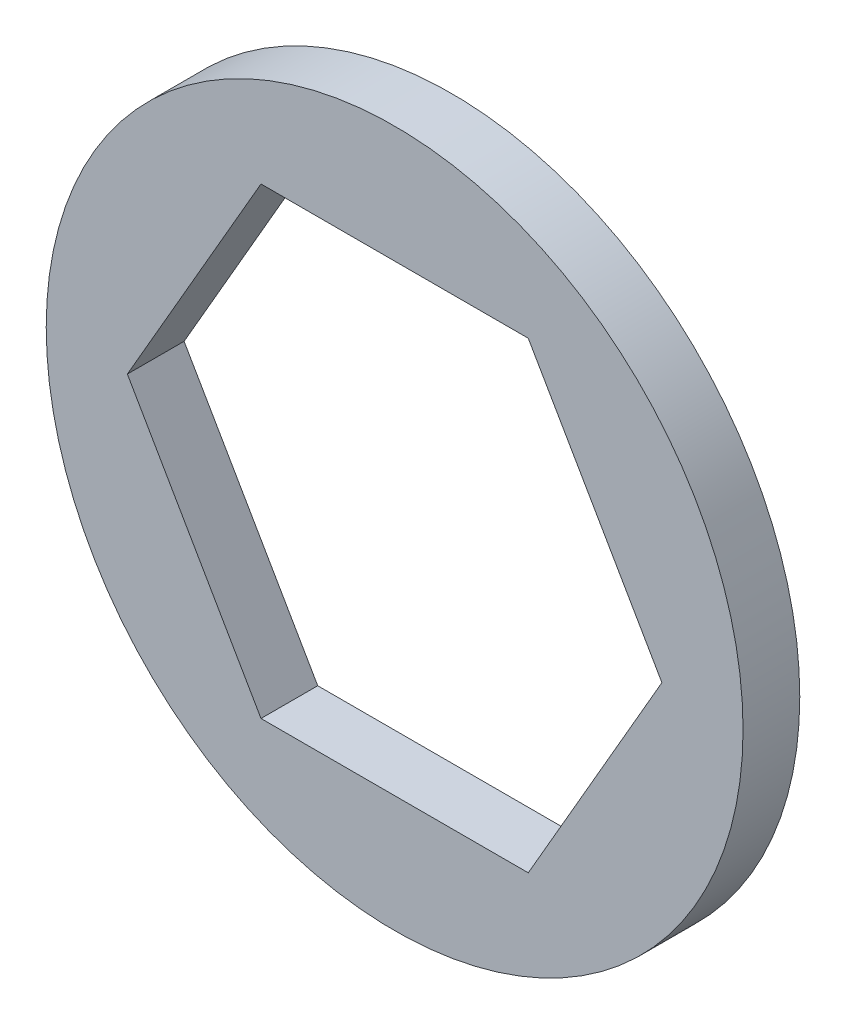
ISO-10303-21;
HEADER;
FILE_DESCRIPTION(('STEP AP214'),'2;1');
FILE_NAME('part.step','',(''),(''),'','','');
FILE_SCHEMA(('AUTOMOTIVE_DESIGN { 1 0 10303 214 1 1 1 1 }'));
ENDSEC;
DATA;
#1=APPLICATION_CONTEXT('core data for automotive mechanical design processes');
#2=APPLICATION_PROTOCOL_DEFINITION('international standard','automotive_design',2000,#1);
#3=PRODUCT_CONTEXT('',#1,'mechanical');
#4=PRODUCT('Part','Part','',(#3));
#5=PRODUCT_RELATED_PRODUCT_CATEGORY('part','',(#4));
#6=PRODUCT_DEFINITION_FORMATION('','',#4);
#7=PRODUCT_DEFINITION_CONTEXT('part definition',#1,'design');
#8=PRODUCT_DEFINITION('design','',#6,#7);
#9=PRODUCT_DEFINITION_SHAPE('','',#8);
#10=(LENGTH_UNIT() NAMED_UNIT(*) SI_UNIT(.MILLI.,.METRE.));
#11=(NAMED_UNIT(*) PLANE_ANGLE_UNIT() SI_UNIT($,.RADIAN.));
#12=(NAMED_UNIT(*) SI_UNIT($,.STERADIAN.) SOLID_ANGLE_UNIT());
#13=UNCERTAINTY_MEASURE_WITH_UNIT(LENGTH_MEASURE(1.E-05),#10,'distance_accuracy_value','');
#14=(GEOMETRIC_REPRESENTATION_CONTEXT(3) GLOBAL_UNCERTAINTY_ASSIGNED_CONTEXT((#13)) GLOBAL_UNIT_ASSIGNED_CONTEXT((#10,
#11,#12)) REPRESENTATION_CONTEXT('',''));
#15=CARTESIAN_POINT('',(0.,0.,0.));
#16=DIRECTION('',(0.,0.,1.));
#17=DIRECTION('',(1.,0.,0.));
#18=AXIS2_PLACEMENT_3D('',#15,#16,#17);
#19=CARTESIAN_POINT('',(0.,0.,0.793750000000003));
#20=DIRECTION('',(0.,0.,1.));
#21=DIRECTION('',(0.,-1.,0.));
#22=AXIS2_PLACEMENT_3D('',#19,#20,#21);
#23=PLANE('',#22);
#24=DIRECTION('',(1.,0.,0.));
#25=VECTOR('',#24,1.);
#26=CARTESIAN_POINT('',(3.73949769354107,6.47700000000007,0.793750000000027));
#27=LINE('',#26,#25);
#28=CARTESIAN_POINT('',(3.73949769354108,6.47700000000007,0.793750000000008));
#29=VERTEX_POINT('',#28);
#30=CARTESIAN_POINT('',(-3.73949769354137,6.47700000000007,0.79375000000001));
#31=VERTEX_POINT('',#30);
#32=EDGE_CURVE('E67',#29,#31,#27,.F.);
#33=ORIENTED_EDGE('',*,*,#32,.F.);
#34=DIRECTION('',(0.5,-0.866025403784439,0.));
#35=VECTOR('',#34,1.);
#36=CARTESIAN_POINT('',(7.47899538708233,1.11022302462516E-13,0.793749999999999));
#37=LINE('',#36,#35);
#38=CARTESIAN_POINT('',(7.47899538708232,1.05708791352843E-13,0.793750000000005));
#39=VERTEX_POINT('',#38);
#40=EDGE_CURVE('E115',#39,#29,#37,.F.);
#41=ORIENTED_EDGE('',*,*,#40,.F.);
#42=DIRECTION('',(-0.5,-0.866025403784439,0.));
#43=VECTOR('',#42,1.);
#44=CARTESIAN_POINT('',(3.73949769354098,-6.47699999999996,0.793750000000017));
#45=LINE('',#44,#43);
#46=CARTESIAN_POINT('',(3.739497693541,-6.47699999999991,0.793750000000008));
#47=VERTEX_POINT('',#46);
#48=EDGE_CURVE('E111',#47,#39,#45,.F.);
#49=ORIENTED_EDGE('',*,*,#48,.F.);
#50=DIRECTION('',(1.,0.,0.));
#51=VECTOR('',#50,1.);
#52=CARTESIAN_POINT('',(-3.7394976935414,-6.4769999999999,0.79375000000001));
#53=LINE('',#52,#51);
#54=CARTESIAN_POINT('',(-3.73949769354132,-6.47699999999988,0.793750000000008));
#55=VERTEX_POINT('',#54);
#56=EDGE_CURVE('E86',#55,#47,#53,.T.);
#57=ORIENTED_EDGE('',*,*,#56,.F.);
#58=DIRECTION('',(-0.5,0.866025403784439,0.));
#59=VECTOR('',#58,1.);
#60=CARTESIAN_POINT('',(-7.47899538708247,1.11022302462516E-13,0.79375000000001));
#61=LINE('',#60,#59);
#62=CARTESIAN_POINT('',(-7.47899538708248,1.16684173353687E-13,0.793750000000005));
#63=VERTEX_POINT('',#62);
#64=EDGE_CURVE('E81',#63,#55,#61,.F.);
#65=ORIENTED_EDGE('',*,*,#64,.F.);
#66=DIRECTION('',(0.5,0.866025403784439,0.));
#67=VECTOR('',#66,1.);
#68=CARTESIAN_POINT('',(-3.73949769354137,6.47700000000007,0.793750000000006));
#69=LINE('',#68,#67);
#70=EDGE_CURVE('E72',#31,#63,#69,.F.);
#71=ORIENTED_EDGE('',*,*,#70,.F.);
#72=EDGE_LOOP('',(#33,#41,#49,#57,#65,#71));
#73=FACE_BOUND('',#72,.T.);
#74=CARTESIAN_POINT('',(0.,0.,0.793750000000003));
#75=DIRECTION('',(0.,0.,-1.));
#76=DIRECTION('',(-1.,0.,0.));
#77=AXIS2_PLACEMENT_3D('',#74,#75,#76);
#78=CIRCLE('',#77,9.74999999999999);
#79=CARTESIAN_POINT('',(-9.74999999999999,0.,0.793750000000003));
#80=VERTEX_POINT('',#79);
#81=EDGE_CURVE('E21',#80,#80,#78,.T.);
#82=ORIENTED_EDGE('',*,*,#81,.F.);
#83=EDGE_LOOP('',(#82));
#84=FACE_BOUND('',#83,.T.);
#85=ADVANCED_FACE('F18',(#73,#84),#23,.T.);
#86=CARTESIAN_POINT('',(0.,0.,0.793750000000003));
#87=DIRECTION('',(0.,0.,-1.));
#88=DIRECTION('',(-1.,0.,0.));
#89=AXIS2_PLACEMENT_3D('',#86,#87,#88);
#90=CYLINDRICAL_SURFACE('',#89,9.74999999999999);
#91=ORIENTED_EDGE('',*,*,#81,.T.);
#92=EDGE_LOOP('',(#91));
#93=FACE_BOUND('',#92,.T.);
#94=CARTESIAN_POINT('',(0.,0.,-0.793749999999989));
#95=DIRECTION('',(0.,0.,-1.));
#96=DIRECTION('',(-1.,0.,0.));
#97=AXIS2_PLACEMENT_3D('',#94,#95,#96);
#98=CIRCLE('',#97,9.74999999999999);
#99=CARTESIAN_POINT('',(-9.74999999999999,0.,-0.793749999999989));
#100=VERTEX_POINT('',#99);
#101=EDGE_CURVE('E97',#100,#100,#98,.F.);
#102=ORIENTED_EDGE('',*,*,#101,.T.);
#103=EDGE_LOOP('',(#102));
#104=FACE_BOUND('',#103,.T.);
#105=ADVANCED_FACE('F182',(#93,#104),#90,.T.);
#106=CARTESIAN_POINT('',(-7.47899538708247,1.11022302462516E-13,0.79375000000001));
#107=DIRECTION('',(0.866025403784439,0.5,0.));
#108=DIRECTION('',(-0.5,0.866025403784439,0.));
#109=AXIS2_PLACEMENT_3D('',#106,#107,#108);
#110=PLANE('',#109);
#111=ORIENTED_EDGE('',*,*,#64,.T.);
#112=DIRECTION('',(0.,0.,1.));
#113=VECTOR('',#112,1.);
#114=CARTESIAN_POINT('',(-3.73949769354134,-6.4769999999999,0.79375000000001));
#115=LINE('',#114,#113);
#116=CARTESIAN_POINT('',(-3.73949769354133,-6.47699999999985,-0.793749999999981));
#117=VERTEX_POINT('',#116);
#118=EDGE_CURVE('E104',#117,#55,#115,.T.);
#119=ORIENTED_EDGE('',*,*,#118,.F.);
#120=DIRECTION('',(-0.499999999999988,0.866025403784446,0.));
#121=VECTOR('',#120,1.);
#122=CARTESIAN_POINT('',(-3.73949769354134,-6.4769999999999,-0.793749999999989));
#123=LINE('',#122,#121);
#124=CARTESIAN_POINT('',(-7.47899538708247,1.14359262055535E-13,-0.793749999999981));
#125=VERTEX_POINT('',#124);
#126=EDGE_CURVE('E93',#117,#125,#123,.T.);
#127=ORIENTED_EDGE('',*,*,#126,.T.);
#128=DIRECTION('',(0.,0.,1.));
#129=VECTOR('',#128,1.);
#130=CARTESIAN_POINT('',(-7.47899538708253,1.44849410244063E-13,0.793750000000006));
#131=LINE('',#130,#129);
#132=EDGE_CURVE('E77',#63,#125,#131,.F.);
#133=ORIENTED_EDGE('',*,*,#132,.F.);
#134=EDGE_LOOP('',(#111,#119,#127,#133));
#135=FACE_BOUND('',#134,.T.);
#136=ADVANCED_FACE('F92',(#135),#110,.T.);
#137=CARTESIAN_POINT('',(-3.73949769354137,6.47700000000007,0.793750000000006));
#138=DIRECTION('',(0.866025403784439,-0.5,0.));
#139=DIRECTION('',(0.5,0.866025403784439,0.));
#140=AXIS2_PLACEMENT_3D('',#137,#138,#139);
#141=PLANE('',#140);
#142=ORIENTED_EDGE('',*,*,#70,.T.);
#143=ORIENTED_EDGE('',*,*,#132,.T.);
#144=DIRECTION('',(0.499999999999983,0.866025403784449,0.));
#145=VECTOR('',#144,1.);
#146=CARTESIAN_POINT('',(-7.47899538708244,1.11022302462516E-13,-0.793749999999989));
#147=LINE('',#146,#145);
#148=CARTESIAN_POINT('',(-3.73949769354137,6.47700000000009,-0.793749999999972));
#149=VERTEX_POINT('',#148);
#150=EDGE_CURVE('E101',#125,#149,#147,.T.);
#151=ORIENTED_EDGE('',*,*,#150,.T.);
#152=DIRECTION('',(0.,0.,1.));
#153=VECTOR('',#152,1.);
#154=CARTESIAN_POINT('',(-3.73949769354137,6.47700000000006,0.793750000000027));
#155=LINE('',#154,#153);
#156=EDGE_CURVE('E79',#31,#149,#155,.F.);
#157=ORIENTED_EDGE('',*,*,#156,.F.);
#158=EDGE_LOOP('',(#142,#143,#151,#157));
#159=FACE_BOUND('',#158,.T.);
#160=ADVANCED_FACE('F74',(#159),#141,.T.);
#161=CARTESIAN_POINT('',(3.73949769354107,6.47700000000007,0.793750000000027));
#162=DIRECTION('',(0.,-1.,0.));
#163=DIRECTION('',(1.,0.,0.));
#164=AXIS2_PLACEMENT_3D('',#161,#162,#163);
#165=PLANE('',#164);
#166=ORIENTED_EDGE('',*,*,#32,.T.);
#167=ORIENTED_EDGE('',*,*,#156,.T.);
#168=DIRECTION('',(1.,0.,0.));
#169=VECTOR('',#168,1.);
#170=CARTESIAN_POINT('',(0.,6.47700000000012,-0.793749999999989));
#171=LINE('',#170,#169);
#172=CARTESIAN_POINT('',(3.73949769354107,6.47700000000009,-0.793749999999973));
#173=VERTEX_POINT('',#172);
#174=EDGE_CURVE('E119',#149,#173,#171,.T.);
#175=ORIENTED_EDGE('',*,*,#174,.T.);
#176=DIRECTION('',(0.,0.,1.));
#177=VECTOR('',#176,1.);
#178=CARTESIAN_POINT('',(3.73949769354113,6.4770000000001,0.793749999999999));
#179=LINE('',#178,#177);
#180=EDGE_CURVE('E113',#29,#173,#179,.F.);
#181=ORIENTED_EDGE('',*,*,#180,.F.);
#182=EDGE_LOOP('',(#166,#167,#175,#181));
#183=FACE_BOUND('',#182,.T.);
#184=ADVANCED_FACE('F118',(#183),#165,.T.);
#185=CARTESIAN_POINT('',(7.47899538708233,1.11022302462516E-13,0.793749999999999));
#186=DIRECTION('',(-0.866025403784439,-0.5,0.));
#187=DIRECTION('',(0.5,-0.866025403784439,0.));
#188=AXIS2_PLACEMENT_3D('',#185,#186,#187);
#189=PLANE('',#188);
#190=ORIENTED_EDGE('',*,*,#40,.T.);
#191=ORIENTED_EDGE('',*,*,#180,.T.);
#192=DIRECTION('',(0.50000000000001,-0.866025403784433,0.));
#193=VECTOR('',#192,1.);
#194=CARTESIAN_POINT('',(3.73949769354107,6.47700000000007,-0.793749999999989));
#195=LINE('',#194,#193);
#196=CARTESIAN_POINT('',(7.47899538708234,0.,-0.793749999999963));
#197=VERTEX_POINT('',#196);
#198=EDGE_CURVE('E126',#173,#197,#195,.T.);
#199=ORIENTED_EDGE('',*,*,#198,.T.);
#200=DIRECTION('',(0.,0.,1.));
#201=VECTOR('',#200,1.);
#202=CARTESIAN_POINT('',(7.47899538708225,1.54390389361936E-13,0.793750000000017));
#203=LINE('',#202,#201);
#204=EDGE_CURVE('E109',#39,#197,#203,.F.);
#205=ORIENTED_EDGE('',*,*,#204,.F.);
#206=EDGE_LOOP('',(#190,#191,#199,#205));
#207=FACE_BOUND('',#206,.T.);
#208=ADVANCED_FACE('F135',(#207),#189,.T.);
#209=CARTESIAN_POINT('',(3.73949769354098,-6.47699999999996,0.793750000000017));
#210=DIRECTION('',(-0.866025403784439,0.5,0.));
#211=DIRECTION('',(-0.5,-0.866025403784439,0.));
#212=AXIS2_PLACEMENT_3D('',#209,#210,#211);
#213=PLANE('',#212);
#214=ORIENTED_EDGE('',*,*,#48,.T.);
#215=ORIENTED_EDGE('',*,*,#204,.T.);
#216=DIRECTION('',(-0.500000000000017,-0.866025403784429,0.));
#217=VECTOR('',#216,1.);
#218=CARTESIAN_POINT('',(7.47899538708238,0.,-0.793749999999989));
#219=LINE('',#218,#217);
#220=CARTESIAN_POINT('',(3.73949769354104,-6.47699999999985,-0.793749999999966));
#221=VERTEX_POINT('',#220);
#222=EDGE_CURVE('E27',#197,#221,#219,.T.);
#223=ORIENTED_EDGE('',*,*,#222,.T.);
#224=DIRECTION('',(0.,0.,1.));
#225=VECTOR('',#224,1.);
#226=CARTESIAN_POINT('',(3.73949769354098,-6.4769999999999,0.79375000000001));
#227=LINE('',#226,#225);
#228=EDGE_CURVE('E35',#47,#221,#227,.F.);
#229=ORIENTED_EDGE('',*,*,#228,.F.);
#230=EDGE_LOOP('',(#214,#215,#223,#229));
#231=FACE_BOUND('',#230,.T.);
#232=ADVANCED_FACE('F132',(#231),#213,.T.);
#233=CARTESIAN_POINT('',(-3.7394976935414,-6.4769999999999,0.79375000000001));
#234=DIRECTION('',(0.,1.,0.));
#235=DIRECTION('',(0.,0.,1.));
#236=AXIS2_PLACEMENT_3D('',#233,#234,#235);
#237=PLANE('',#236);
#238=ORIENTED_EDGE('',*,*,#56,.T.);
#239=ORIENTED_EDGE('',*,*,#228,.T.);
#240=DIRECTION('',(1.,0.,0.));
#241=VECTOR('',#240,1.);
#242=CARTESIAN_POINT('',(0.,-6.47699999999984,-0.793749999999989));
#243=LINE('',#242,#241);
#244=EDGE_CURVE('E11',#221,#117,#243,.F.);
#245=ORIENTED_EDGE('',*,*,#244,.T.);
#246=ORIENTED_EDGE('',*,*,#118,.T.);
#247=EDGE_LOOP('',(#238,#239,#245,#246));
#248=FACE_BOUND('',#247,.T.);
#249=ADVANCED_FACE('F144',(#248),#237,.T.);
#250=CARTESIAN_POINT('',(0.,0.,-0.793749999999989));
#251=DIRECTION('',(0.,0.,1.));
#252=DIRECTION('',(0.,-1.,0.));
#253=AXIS2_PLACEMENT_3D('',#250,#251,#252);
#254=PLANE('',#253);
#255=ORIENTED_EDGE('',*,*,#222,.F.);
#256=ORIENTED_EDGE('',*,*,#198,.F.);
#257=ORIENTED_EDGE('',*,*,#174,.F.);
#258=ORIENTED_EDGE('',*,*,#150,.F.);
#259=ORIENTED_EDGE('',*,*,#126,.F.);
#260=ORIENTED_EDGE('',*,*,#244,.F.);
#261=EDGE_LOOP('',(#255,#256,#257,#258,#259,#260));
#262=FACE_BOUND('',#261,.T.);
#263=ORIENTED_EDGE('',*,*,#101,.F.);
#264=EDGE_LOOP('',(#263));
#265=FACE_BOUND('',#264,.T.);
#266=ADVANCED_FACE('F123',(#262,#265),#254,.F.);
#267=CLOSED_SHELL('',(#85,#105,#136,#160,#184,#208,#232,#249,#266));
#268=MANIFOLD_SOLID_BREP('B1',#267);
#269=ADVANCED_BREP_SHAPE_REPRESENTATION('',(#18,#268),#14);
#270=SHAPE_DEFINITION_REPRESENTATION(#9,#269);
ENDSEC;
END-ISO-10303-21;
